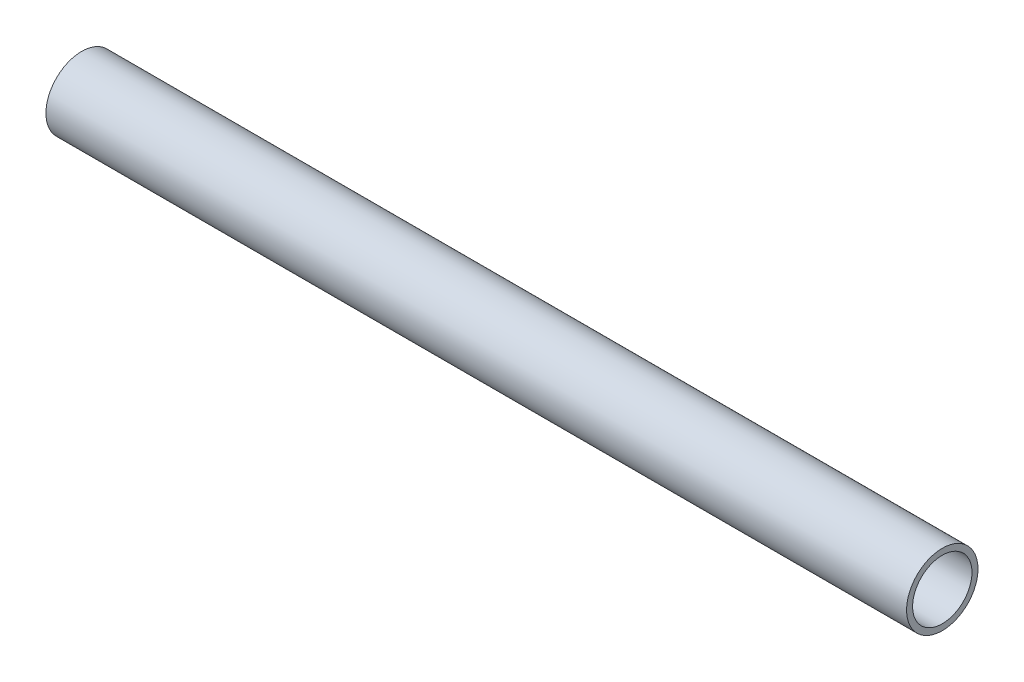
ISO-10303-21;
HEADER;
FILE_DESCRIPTION(('STEP AP214'),'2;1');
FILE_NAME('part.step','',(''),(''),'','','');
FILE_SCHEMA(('AUTOMOTIVE_DESIGN { 1 0 10303 214 1 1 1 1 }'));
ENDSEC;
DATA;
#1=APPLICATION_CONTEXT('core data for automotive mechanical design processes');
#2=APPLICATION_PROTOCOL_DEFINITION('international standard','automotive_design',2000,#1);
#3=PRODUCT_CONTEXT('',#1,'mechanical');
#4=PRODUCT('Part','Part','',(#3));
#5=PRODUCT_RELATED_PRODUCT_CATEGORY('part','',(#4));
#6=PRODUCT_DEFINITION_FORMATION('','',#4);
#7=PRODUCT_DEFINITION_CONTEXT('part definition',#1,'design');
#8=PRODUCT_DEFINITION('design','',#6,#7);
#9=PRODUCT_DEFINITION_SHAPE('','',#8);
#10=(LENGTH_UNIT() NAMED_UNIT(*) SI_UNIT(.MILLI.,.METRE.));
#11=(NAMED_UNIT(*) PLANE_ANGLE_UNIT() SI_UNIT($,.RADIAN.));
#12=(NAMED_UNIT(*) SI_UNIT($,.STERADIAN.) SOLID_ANGLE_UNIT());
#13=UNCERTAINTY_MEASURE_WITH_UNIT(LENGTH_MEASURE(1.E-05),#10,'distance_accuracy_value','');
#14=(GEOMETRIC_REPRESENTATION_CONTEXT(3) GLOBAL_UNCERTAINTY_ASSIGNED_CONTEXT((#13)) GLOBAL_UNIT_ASSIGNED_CONTEXT((#10,
#11,#12)) REPRESENTATION_CONTEXT('',''));
#15=CARTESIAN_POINT('',(0.,0.,0.));
#16=DIRECTION('',(0.,0.,1.));
#17=DIRECTION('',(1.,0.,0.));
#18=AXIS2_PLACEMENT_3D('',#15,#16,#17);
#19=CARTESIAN_POINT('',(-254.,0.,0.));
#20=DIRECTION('',(1.,0.,0.));
#21=DIRECTION('',(0.,0.,-1.));
#22=AXIS2_PLACEMENT_3D('',#19,#20,#21);
#23=CYLINDRICAL_SURFACE('',#22,17.526);
#24=CARTESIAN_POINT('',(254.,0.,0.));
#25=DIRECTION('',(1.,0.,0.));
#26=DIRECTION('',(0.,0.,-1.));
#27=AXIS2_PLACEMENT_3D('',#24,#25,#26);
#28=CIRCLE('',#27,17.526);
#29=CARTESIAN_POINT('',(254.,0.,-17.526));
#30=VERTEX_POINT('',#29);
#31=EDGE_CURVE('E17',#30,#30,#28,.F.);
#32=ORIENTED_EDGE('',*,*,#31,.F.);
#33=EDGE_LOOP('',(#32));
#34=FACE_BOUND('',#33,.T.);
#35=CARTESIAN_POINT('',(-254.,0.,0.));
#36=DIRECTION('',(1.,0.,0.));
#37=DIRECTION('',(0.,0.,-1.));
#38=AXIS2_PLACEMENT_3D('',#35,#36,#37);
#39=CIRCLE('',#38,17.526);
#40=CARTESIAN_POINT('',(-254.,0.,-17.526));
#41=VERTEX_POINT('',#40);
#42=EDGE_CURVE('E26',#41,#41,#39,.F.);
#43=ORIENTED_EDGE('',*,*,#42,.T.);
#44=EDGE_LOOP('',(#43));
#45=FACE_BOUND('',#44,.T.);
#46=ADVANCED_FACE('F14',(#34,#45),#23,.F.);
#47=CARTESIAN_POINT('',(254.,0.,0.));
#48=DIRECTION('',(1.,0.,0.));
#49=DIRECTION('',(0.,0.,-1.));
#50=AXIS2_PLACEMENT_3D('',#47,#48,#49);
#51=PLANE('',#50);
#52=ORIENTED_EDGE('',*,*,#31,.T.);
#53=EDGE_LOOP('',(#52));
#54=FACE_BOUND('',#53,.T.);
#55=CARTESIAN_POINT('',(254.,0.,0.));
#56=DIRECTION('',(1.,0.,0.));
#57=DIRECTION('',(0.,0.,-1.));
#58=AXIS2_PLACEMENT_3D('',#55,#56,#57);
#59=CIRCLE('',#58,21.082);
#60=CARTESIAN_POINT('',(254.,0.,-21.082));
#61=VERTEX_POINT('',#60);
#62=EDGE_CURVE('E21',#61,#61,#59,.F.);
#63=ORIENTED_EDGE('',*,*,#62,.F.);
#64=EDGE_LOOP('',(#63));
#65=FACE_BOUND('',#64,.T.);
#66=ADVANCED_FACE('F34',(#54,#65),#51,.T.);
#67=CARTESIAN_POINT('',(-254.,0.,0.));
#68=DIRECTION('',(1.,0.,0.));
#69=DIRECTION('',(0.,0.,-1.));
#70=AXIS2_PLACEMENT_3D('',#67,#68,#69);
#71=PLANE('',#70);
#72=ORIENTED_EDGE('',*,*,#42,.F.);
#73=EDGE_LOOP('',(#72));
#74=FACE_BOUND('',#73,.T.);
#75=CARTESIAN_POINT('',(-254.,0.,0.));
#76=DIRECTION('',(1.,0.,0.));
#77=DIRECTION('',(0.,0.,-1.));
#78=AXIS2_PLACEMENT_3D('',#75,#76,#77);
#79=CIRCLE('',#78,21.082);
#80=CARTESIAN_POINT('',(-254.,0.,-21.082));
#81=VERTEX_POINT('',#80);
#82=EDGE_CURVE('E10',#81,#81,#79,.T.);
#83=ORIENTED_EDGE('',*,*,#82,.F.);
#84=EDGE_LOOP('',(#83));
#85=FACE_BOUND('',#84,.T.);
#86=ADVANCED_FACE('F42',(#74,#85),#71,.F.);
#87=CARTESIAN_POINT('',(-254.,0.,0.));
#88=DIRECTION('',(1.,0.,0.));
#89=DIRECTION('',(0.,0.,-1.));
#90=AXIS2_PLACEMENT_3D('',#87,#88,#89);
#91=CYLINDRICAL_SURFACE('',#90,21.082);
#92=ORIENTED_EDGE('',*,*,#62,.T.);
#93=EDGE_LOOP('',(#92));
#94=FACE_BOUND('',#93,.T.);
#95=ORIENTED_EDGE('',*,*,#82,.T.);
#96=EDGE_LOOP('',(#95));
#97=FACE_BOUND('',#96,.T.);
#98=ADVANCED_FACE('F43',(#94,#97),#91,.T.);
#99=CLOSED_SHELL('',(#46,#66,#86,#98));
#100=MANIFOLD_SOLID_BREP('B1',#99);
#101=ADVANCED_BREP_SHAPE_REPRESENTATION('',(#18,#100),#14);
#102=SHAPE_DEFINITION_REPRESENTATION(#9,#101);
ENDSEC;
END-ISO-10303-21;
